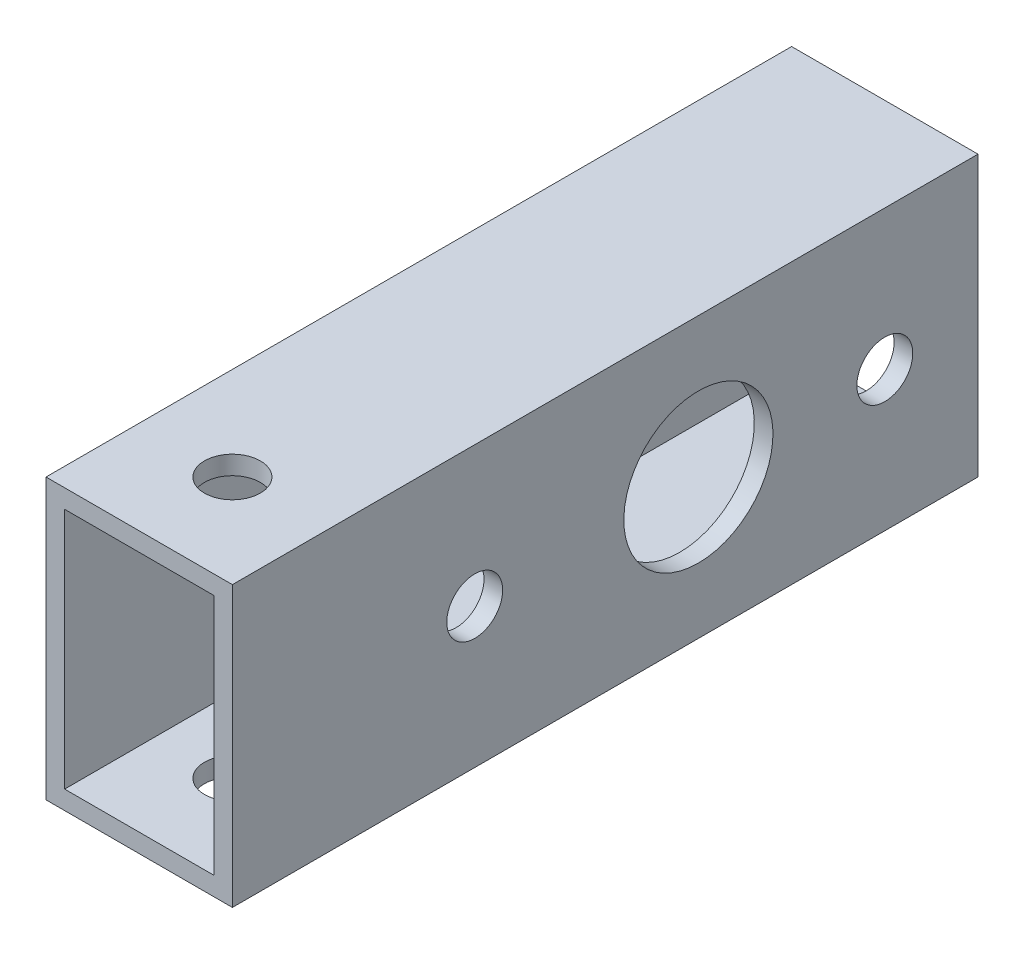
ISO-10303-21;
HEADER;
FILE_DESCRIPTION(('STEP AP214'),'2;1');
FILE_NAME('part.step','',(''),(''),'','','');
FILE_SCHEMA(('AUTOMOTIVE_DESIGN { 1 0 10303 214 1 1 1 1 }'));
ENDSEC;
DATA;
#1=APPLICATION_CONTEXT('core data for automotive mechanical design processes');
#2=APPLICATION_PROTOCOL_DEFINITION('international standard','automotive_design',2000,#1);
#3=PRODUCT_CONTEXT('',#1,'mechanical');
#4=PRODUCT('Part','Part','',(#3));
#5=PRODUCT_RELATED_PRODUCT_CATEGORY('part','',(#4));
#6=PRODUCT_DEFINITION_FORMATION('','',#4);
#7=PRODUCT_DEFINITION_CONTEXT('part definition',#1,'design');
#8=PRODUCT_DEFINITION('design','',#6,#7);
#9=PRODUCT_DEFINITION_SHAPE('','',#8);
#10=(LENGTH_UNIT() NAMED_UNIT(*) SI_UNIT(.MILLI.,.METRE.));
#11=(NAMED_UNIT(*) PLANE_ANGLE_UNIT() SI_UNIT($,.RADIAN.));
#12=(NAMED_UNIT(*) SI_UNIT($,.STERADIAN.) SOLID_ANGLE_UNIT());
#13=UNCERTAINTY_MEASURE_WITH_UNIT(LENGTH_MEASURE(1.E-05),#10,'distance_accuracy_value','');
#14=(GEOMETRIC_REPRESENTATION_CONTEXT(3) GLOBAL_UNCERTAINTY_ASSIGNED_CONTEXT((#13)) GLOBAL_UNIT_ASSIGNED_CONTEXT((#10,
#11,#12)) REPRESENTATION_CONTEXT('',''));
#15=CARTESIAN_POINT('',(0.,0.,0.));
#16=DIRECTION('',(0.,0.,1.));
#17=DIRECTION('',(1.,0.,0.));
#18=AXIS2_PLACEMENT_3D('',#15,#16,#17);
#19=CARTESIAN_POINT('',(0.,0.,40.));
#20=DIRECTION('',(0.,0.,1.));
#21=DIRECTION('',(1.,0.,0.));
#22=AXIS2_PLACEMENT_3D('',#19,#20,#21);
#23=PLANE('',#22);
#24=DIRECTION('',(0.,1.,0.));
#25=VECTOR('',#24,1.);
#26=CARTESIAN_POINT('',(93.1003139228142,55.9367021607542,40.));
#27=LINE('',#26,#25);
#28=CARTESIAN_POINT('',(93.1003139228142,40.9367021607542,40.));
#29=VERTEX_POINT('',#28);
#30=CARTESIAN_POINT('',(93.1003139228142,55.9367021607542,40.));
#31=VERTEX_POINT('',#30);
#32=EDGE_CURVE('E168',#29,#31,#27,.T.);
#33=ORIENTED_EDGE('',*,*,#32,.T.);
#34=DIRECTION('',(-1.,0.,0.));
#35=VECTOR('',#34,1.);
#36=CARTESIAN_POINT('',(93.1003139228142,55.9367021607542,40.));
#37=LINE('',#36,#35);
#38=CARTESIAN_POINT('',(83.1003139228142,55.9367021607542,40.));
#39=VERTEX_POINT('',#38);
#40=EDGE_CURVE('E171',#31,#39,#37,.T.);
#41=ORIENTED_EDGE('',*,*,#40,.T.);
#42=DIRECTION('',(0.,-1.,0.));
#43=VECTOR('',#42,1.);
#44=CARTESIAN_POINT('',(83.1003139228142,55.9367021607542,40.));
#45=LINE('',#44,#43);
#46=CARTESIAN_POINT('',(83.1003139228142,40.9367021607542,40.));
#47=VERTEX_POINT('',#46);
#48=EDGE_CURVE('E174',#39,#47,#45,.T.);
#49=ORIENTED_EDGE('',*,*,#48,.T.);
#50=DIRECTION('',(1.,0.,0.));
#51=VECTOR('',#50,1.);
#52=CARTESIAN_POINT('',(93.1003139228142,40.9367021607542,40.));
#53=LINE('',#52,#51);
#54=EDGE_CURVE('E176',#47,#29,#53,.T.);
#55=ORIENTED_EDGE('',*,*,#54,.T.);
#56=EDGE_LOOP('',(#33,#41,#49,#55));
#57=FACE_BOUND('',#56,.T.);
#58=DIRECTION('',(-1.,0.,0.));
#59=VECTOR('',#58,1.);
#60=CARTESIAN_POINT('',(0.,54.9367021607542,40.));
#61=LINE('',#60,#59);
#62=CARTESIAN_POINT('',(92.1003139228142,54.9367021607542,40.));
#63=VERTEX_POINT('',#62);
#64=CARTESIAN_POINT('',(84.1003139228142,54.9367021607542,40.));
#65=VERTEX_POINT('',#64);
#66=EDGE_CURVE('E138',#63,#65,#61,.T.);
#67=ORIENTED_EDGE('',*,*,#66,.F.);
#68=DIRECTION('',(0.,1.,0.));
#69=VECTOR('',#68,1.);
#70=CARTESIAN_POINT('',(92.1003139228142,0.,40.));
#71=LINE('',#70,#69);
#72=CARTESIAN_POINT('',(92.1003139228142,41.9367021607542,40.));
#73=VERTEX_POINT('',#72);
#74=EDGE_CURVE('E130',#73,#63,#71,.T.);
#75=ORIENTED_EDGE('',*,*,#74,.F.);
#76=DIRECTION('',(1.,0.,0.));
#77=VECTOR('',#76,1.);
#78=CARTESIAN_POINT('',(0.,41.9367021607542,40.));
#79=LINE('',#78,#77);
#80=CARTESIAN_POINT('',(84.1003139228142,41.9367021607542,40.));
#81=VERTEX_POINT('',#80);
#82=EDGE_CURVE('E152',#81,#73,#79,.T.);
#83=ORIENTED_EDGE('',*,*,#82,.F.);
#84=DIRECTION('',(0.,-1.,0.));
#85=VECTOR('',#84,1.);
#86=CARTESIAN_POINT('',(84.1003139228142,0.,40.));
#87=LINE('',#86,#85);
#88=EDGE_CURVE('E150',#65,#81,#87,.T.);
#89=ORIENTED_EDGE('',*,*,#88,.F.);
#90=EDGE_LOOP('',(#67,#75,#83,#89));
#91=FACE_BOUND('',#90,.T.);
#92=ADVANCED_FACE('F63',(#57,#91),#23,.T.);
#93=CARTESIAN_POINT('',(0.,0.,0.));
#94=DIRECTION('',(0.,0.,1.));
#95=DIRECTION('',(1.,0.,0.));
#96=AXIS2_PLACEMENT_3D('',#93,#94,#95);
#97=PLANE('',#96);
#98=DIRECTION('',(0.,1.,0.));
#99=VECTOR('',#98,1.);
#100=CARTESIAN_POINT('',(93.1003139228142,55.9367021607542,0.));
#101=LINE('',#100,#99);
#102=CARTESIAN_POINT('',(93.1003139228142,40.9367021607542,0.));
#103=VERTEX_POINT('',#102);
#104=CARTESIAN_POINT('',(93.1003139228142,55.9367021607542,0.));
#105=VERTEX_POINT('',#104);
#106=EDGE_CURVE('E146',#103,#105,#101,.T.);
#107=ORIENTED_EDGE('',*,*,#106,.F.);
#108=DIRECTION('',(1.,0.,0.));
#109=VECTOR('',#108,1.);
#110=CARTESIAN_POINT('',(93.1003139228142,40.9367021607542,0.));
#111=LINE('',#110,#109);
#112=CARTESIAN_POINT('',(83.1003139228142,40.9367021607542,0.));
#113=VERTEX_POINT('',#112);
#114=EDGE_CURVE('E172',#113,#103,#111,.T.);
#115=ORIENTED_EDGE('',*,*,#114,.F.);
#116=DIRECTION('',(0.,-1.,0.));
#117=VECTOR('',#116,1.);
#118=CARTESIAN_POINT('',(83.1003139228142,55.9367021607542,0.));
#119=LINE('',#118,#117);
#120=CARTESIAN_POINT('',(83.1003139228142,55.9367021607542,0.));
#121=VERTEX_POINT('',#120);
#122=EDGE_CURVE('E183',#121,#113,#119,.T.);
#123=ORIENTED_EDGE('',*,*,#122,.F.);
#124=DIRECTION('',(-1.,0.,0.));
#125=VECTOR('',#124,1.);
#126=CARTESIAN_POINT('',(93.1003139228142,55.9367021607542,0.));
#127=LINE('',#126,#125);
#128=EDGE_CURVE('E181',#105,#121,#127,.T.);
#129=ORIENTED_EDGE('',*,*,#128,.F.);
#130=EDGE_LOOP('',(#107,#115,#123,#129));
#131=FACE_BOUND('',#130,.T.);
#132=DIRECTION('',(0.,1.,0.));
#133=VECTOR('',#132,1.);
#134=CARTESIAN_POINT('',(92.1003139228142,0.,0.));
#135=LINE('',#134,#133);
#136=CARTESIAN_POINT('',(92.1003139228142,41.9367021607542,0.));
#137=VERTEX_POINT('',#136);
#138=CARTESIAN_POINT('',(92.1003139228142,54.9367021607542,0.));
#139=VERTEX_POINT('',#138);
#140=EDGE_CURVE('E88',#137,#139,#135,.T.);
#141=ORIENTED_EDGE('',*,*,#140,.T.);
#142=DIRECTION('',(-1.,0.,0.));
#143=VECTOR('',#142,1.);
#144=CARTESIAN_POINT('',(0.,54.9367021607542,0.));
#145=LINE('',#144,#143);
#146=CARTESIAN_POINT('',(84.1003139228142,54.9367021607542,0.));
#147=VERTEX_POINT('',#146);
#148=EDGE_CURVE('E145',#139,#147,#145,.T.);
#149=ORIENTED_EDGE('',*,*,#148,.T.);
#150=DIRECTION('',(0.,-1.,0.));
#151=VECTOR('',#150,1.);
#152=CARTESIAN_POINT('',(84.1003139228142,0.,0.));
#153=LINE('',#152,#151);
#154=CARTESIAN_POINT('',(84.1003139228142,41.9367021607542,0.));
#155=VERTEX_POINT('',#154);
#156=EDGE_CURVE('E160',#147,#155,#153,.T.);
#157=ORIENTED_EDGE('',*,*,#156,.T.);
#158=DIRECTION('',(1.,0.,0.));
#159=VECTOR('',#158,1.);
#160=CARTESIAN_POINT('',(0.,41.9367021607542,0.));
#161=LINE('',#160,#159);
#162=EDGE_CURVE('E139',#155,#137,#161,.T.);
#163=ORIENTED_EDGE('',*,*,#162,.T.);
#164=EDGE_LOOP('',(#141,#149,#157,#163));
#165=FACE_BOUND('',#164,.T.);
#166=ADVANCED_FACE('F253',(#131,#165),#97,.F.);
#167=CARTESIAN_POINT('',(93.1003139228142,55.9367021607542,40.));
#168=DIRECTION('',(-1.,0.,0.));
#169=DIRECTION('',(0.,0.,1.));
#170=AXIS2_PLACEMENT_3D('',#167,#168,#169);
#171=PLANE('',#170);
#172=CARTESIAN_POINT('',(93.1003139228142,48.4367021607542,5.));
#173=DIRECTION('',(-1.,0.,0.));
#174=DIRECTION('',(0.,-1.,0.));
#175=AXIS2_PLACEMENT_3D('',#172,#173,#174);
#176=CIRCLE('',#175,1.5);
#177=CARTESIAN_POINT('',(93.1003139228142,46.9367021607542,5.));
#178=VERTEX_POINT('',#177);
#179=EDGE_CURVE('E219',#178,#178,#176,.T.);
#180=ORIENTED_EDGE('',*,*,#179,.T.);
#181=EDGE_LOOP('',(#180));
#182=FACE_BOUND('',#181,.T.);
#183=CARTESIAN_POINT('',(93.1003139228142,48.4367021607542,27.));
#184=DIRECTION('',(-1.,0.,0.));
#185=DIRECTION('',(0.,-1.,0.));
#186=AXIS2_PLACEMENT_3D('',#183,#184,#185);
#187=CIRCLE('',#186,1.5);
#188=CARTESIAN_POINT('',(93.1003139228142,46.9367021607542,27.));
#189=VERTEX_POINT('',#188);
#190=EDGE_CURVE('E226',#189,#189,#187,.T.);
#191=ORIENTED_EDGE('',*,*,#190,.T.);
#192=EDGE_LOOP('',(#191));
#193=FACE_BOUND('',#192,.T.);
#194=CARTESIAN_POINT('',(93.1003139228142,48.4367021607542,15.));
#195=DIRECTION('',(-1.,0.,0.));
#196=DIRECTION('',(0.,-1.,0.));
#197=AXIS2_PLACEMENT_3D('',#194,#195,#196);
#198=CIRCLE('',#197,4.);
#199=CARTESIAN_POINT('',(93.1003139228142,44.4367021607542,15.));
#200=VERTEX_POINT('',#199);
#201=EDGE_CURVE('E197',#200,#200,#198,.T.);
#202=ORIENTED_EDGE('',*,*,#201,.T.);
#203=EDGE_LOOP('',(#202));
#204=FACE_BOUND('',#203,.T.);
#205=ORIENTED_EDGE('',*,*,#106,.T.);
#206=DIRECTION('',(0.,0.,-1.));
#207=VECTOR('',#206,1.);
#208=CARTESIAN_POINT('',(93.1003139228142,55.9367021607542,40.));
#209=LINE('',#208,#207);
#210=EDGE_CURVE('E12',#31,#105,#209,.T.);
#211=ORIENTED_EDGE('',*,*,#210,.F.);
#212=ORIENTED_EDGE('',*,*,#32,.F.);
#213=DIRECTION('',(0.,0.,-1.));
#214=VECTOR('',#213,1.);
#215=CARTESIAN_POINT('',(93.1003139228142,40.9367021607542,40.));
#216=LINE('',#215,#214);
#217=EDGE_CURVE('E178',#29,#103,#216,.T.);
#218=ORIENTED_EDGE('',*,*,#217,.T.);
#219=EDGE_LOOP('',(#205,#211,#212,#218));
#220=FACE_BOUND('',#219,.T.);
#221=ADVANCED_FACE('F65',(#182,#193,#204,#220),#171,.F.);
#222=CARTESIAN_POINT('',(93.1003139228142,55.9367021607542,40.));
#223=DIRECTION('',(0.,-1.,0.));
#224=DIRECTION('',(0.,0.,-1.));
#225=AXIS2_PLACEMENT_3D('',#222,#223,#224);
#226=PLANE('',#225);
#227=CARTESIAN_POINT('',(88.1003139228142,55.9367021607542,35.));
#228=DIRECTION('',(0.,-1.,0.));
#229=DIRECTION('',(0.,0.,-1.));
#230=AXIS2_PLACEMENT_3D('',#227,#228,#229);
#231=CIRCLE('',#230,1.5);
#232=CARTESIAN_POINT('',(88.1003139228142,55.9367021607542,33.5));
#233=VERTEX_POINT('',#232);
#234=EDGE_CURVE('E236',#233,#233,#231,.T.);
#235=ORIENTED_EDGE('',*,*,#234,.T.);
#236=EDGE_LOOP('',(#235));
#237=FACE_BOUND('',#236,.T.);
#238=ORIENTED_EDGE('',*,*,#128,.T.);
#239=DIRECTION('',(0.,0.,-1.));
#240=VECTOR('',#239,1.);
#241=CARTESIAN_POINT('',(83.1003139228142,55.9367021607542,40.));
#242=LINE('',#241,#240);
#243=EDGE_CURVE('E72',#39,#121,#242,.T.);
#244=ORIENTED_EDGE('',*,*,#243,.F.);
#245=ORIENTED_EDGE('',*,*,#40,.F.);
#246=ORIENTED_EDGE('',*,*,#210,.T.);
#247=EDGE_LOOP('',(#238,#244,#245,#246));
#248=FACE_BOUND('',#247,.T.);
#249=ADVANCED_FACE('F280',(#237,#248),#226,.F.);
#250=CARTESIAN_POINT('',(83.1003139228142,55.9367021607542,40.));
#251=DIRECTION('',(1.,0.,0.));
#252=DIRECTION('',(0.,1.,0.));
#253=AXIS2_PLACEMENT_3D('',#250,#251,#252);
#254=PLANE('',#253);
#255=CARTESIAN_POINT('',(83.1003139228142,48.4367021607542,5.));
#256=DIRECTION('',(-1.,0.,0.));
#257=DIRECTION('',(0.,-1.,0.));
#258=AXIS2_PLACEMENT_3D('',#255,#256,#257);
#259=CIRCLE('',#258,1.5);
#260=CARTESIAN_POINT('',(83.1003139228142,46.9367021607542,5.));
#261=VERTEX_POINT('',#260);
#262=EDGE_CURVE('E222',#261,#261,#259,.T.);
#263=ORIENTED_EDGE('',*,*,#262,.F.);
#264=EDGE_LOOP('',(#263));
#265=FACE_BOUND('',#264,.T.);
#266=CARTESIAN_POINT('',(83.1003139228142,48.4367021607542,27.));
#267=DIRECTION('',(-1.,0.,0.));
#268=DIRECTION('',(0.,-1.,0.));
#269=AXIS2_PLACEMENT_3D('',#266,#267,#268);
#270=CIRCLE('',#269,1.5);
#271=CARTESIAN_POINT('',(83.1003139228142,46.9367021607542,27.));
#272=VERTEX_POINT('',#271);
#273=EDGE_CURVE('E216',#272,#272,#270,.T.);
#274=ORIENTED_EDGE('',*,*,#273,.F.);
#275=EDGE_LOOP('',(#274));
#276=FACE_BOUND('',#275,.T.);
#277=CARTESIAN_POINT('',(83.1003139228142,48.4367021607542,15.));
#278=DIRECTION('',(-1.,0.,0.));
#279=DIRECTION('',(0.,-1.,0.));
#280=AXIS2_PLACEMENT_3D('',#277,#278,#279);
#281=CIRCLE('',#280,4.);
#282=CARTESIAN_POINT('',(83.1003139228142,44.4367021607542,15.));
#283=VERTEX_POINT('',#282);
#284=EDGE_CURVE('E213',#283,#283,#281,.T.);
#285=ORIENTED_EDGE('',*,*,#284,.F.);
#286=EDGE_LOOP('',(#285));
#287=FACE_BOUND('',#286,.T.);
#288=ORIENTED_EDGE('',*,*,#122,.T.);
#289=DIRECTION('',(0.,0.,-1.));
#290=VECTOR('',#289,1.);
#291=CARTESIAN_POINT('',(83.1003139228142,40.9367021607542,40.));
#292=LINE('',#291,#290);
#293=EDGE_CURVE('E188',#47,#113,#292,.T.);
#294=ORIENTED_EDGE('',*,*,#293,.F.);
#295=ORIENTED_EDGE('',*,*,#48,.F.);
#296=ORIENTED_EDGE('',*,*,#243,.T.);
#297=EDGE_LOOP('',(#288,#294,#295,#296));
#298=FACE_BOUND('',#297,.T.);
#299=ADVANCED_FACE('F277',(#265,#276,#287,#298),#254,.F.);
#300=CARTESIAN_POINT('',(93.1003139228142,40.9367021607542,40.));
#301=DIRECTION('',(0.,1.,0.));
#302=DIRECTION('',(0.,0.,1.));
#303=AXIS2_PLACEMENT_3D('',#300,#301,#302);
#304=PLANE('',#303);
#305=CARTESIAN_POINT('',(88.1003139228142,40.9367021607542,35.));
#306=DIRECTION('',(0.,-1.,0.));
#307=DIRECTION('',(0.,0.,-1.));
#308=AXIS2_PLACEMENT_3D('',#305,#306,#307);
#309=CIRCLE('',#308,1.5);
#310=CARTESIAN_POINT('',(88.1003139228142,40.9367021607542,33.5));
#311=VERTEX_POINT('',#310);
#312=EDGE_CURVE('E233',#311,#311,#309,.T.);
#313=ORIENTED_EDGE('',*,*,#312,.F.);
#314=EDGE_LOOP('',(#313));
#315=FACE_BOUND('',#314,.T.);
#316=ORIENTED_EDGE('',*,*,#114,.T.);
#317=ORIENTED_EDGE('',*,*,#217,.F.);
#318=ORIENTED_EDGE('',*,*,#54,.F.);
#319=ORIENTED_EDGE('',*,*,#293,.T.);
#320=EDGE_LOOP('',(#316,#317,#318,#319));
#321=FACE_BOUND('',#320,.T.);
#322=ADVANCED_FACE('F274',(#315,#321),#304,.F.);
#323=CARTESIAN_POINT('',(92.1003139228142,0.,40.));
#324=DIRECTION('',(-1.,0.,0.));
#325=DIRECTION('',(0.,0.,1.));
#326=AXIS2_PLACEMENT_3D('',#323,#324,#325);
#327=PLANE('',#326);
#328=CARTESIAN_POINT('',(92.1003139228142,48.4367021607542,5.));
#329=DIRECTION('',(-1.,0.,0.));
#330=DIRECTION('',(0.,0.,1.));
#331=AXIS2_PLACEMENT_3D('',#328,#329,#330);
#332=CIRCLE('',#331,1.5);
#333=CARTESIAN_POINT('',(92.1003139228142,48.4367021607542,6.50000000000001));
#334=VERTEX_POINT('',#333);
#335=EDGE_CURVE('E158',#334,#334,#332,.T.);
#336=ORIENTED_EDGE('',*,*,#335,.F.);
#337=EDGE_LOOP('',(#336));
#338=FACE_BOUND('',#337,.T.);
#339=CARTESIAN_POINT('',(92.1003139228142,48.4367021607542,27.));
#340=DIRECTION('',(-1.,0.,0.));
#341=DIRECTION('',(0.,0.,1.));
#342=AXIS2_PLACEMENT_3D('',#339,#340,#341);
#343=CIRCLE('',#342,1.5);
#344=CARTESIAN_POINT('',(92.1003139228142,48.4367021607542,28.5));
#345=VERTEX_POINT('',#344);
#346=EDGE_CURVE('E200',#345,#345,#343,.T.);
#347=ORIENTED_EDGE('',*,*,#346,.F.);
#348=EDGE_LOOP('',(#347));
#349=FACE_BOUND('',#348,.T.);
#350=CARTESIAN_POINT('',(92.1003139228142,48.4367021607542,15.));
#351=DIRECTION('',(-1.,0.,0.));
#352=DIRECTION('',(0.,0.,1.));
#353=AXIS2_PLACEMENT_3D('',#350,#351,#352);
#354=CIRCLE('',#353,4.);
#355=CARTESIAN_POINT('',(92.1003139228142,48.4367021607542,19.));
#356=VERTEX_POINT('',#355);
#357=EDGE_CURVE('E196',#356,#356,#354,.T.);
#358=ORIENTED_EDGE('',*,*,#357,.F.);
#359=EDGE_LOOP('',(#358));
#360=FACE_BOUND('',#359,.T.);
#361=ORIENTED_EDGE('',*,*,#140,.F.);
#362=DIRECTION('',(0.,0.,-1.));
#363=VECTOR('',#362,1.);
#364=CARTESIAN_POINT('',(92.1003139228142,41.9367021607542,40.));
#365=LINE('',#364,#363);
#366=EDGE_CURVE('E134',#73,#137,#365,.T.);
#367=ORIENTED_EDGE('',*,*,#366,.F.);
#368=ORIENTED_EDGE('',*,*,#74,.T.);
#369=DIRECTION('',(0.,0.,-1.));
#370=VECTOR('',#369,1.);
#371=CARTESIAN_POINT('',(92.1003139228142,54.9367021607542,40.));
#372=LINE('',#371,#370);
#373=EDGE_CURVE('E133',#63,#139,#372,.T.);
#374=ORIENTED_EDGE('',*,*,#373,.T.);
#375=EDGE_LOOP('',(#361,#367,#368,#374));
#376=FACE_BOUND('',#375,.T.);
#377=ADVANCED_FACE('F132',(#338,#349,#360,#376),#327,.T.);
#378=CARTESIAN_POINT('',(0.,54.9367021607542,40.));
#379=DIRECTION('',(0.,-1.,0.));
#380=DIRECTION('',(0.,0.,-1.));
#381=AXIS2_PLACEMENT_3D('',#378,#379,#380);
#382=PLANE('',#381);
#383=CARTESIAN_POINT('',(88.1003139228142,54.9367021607542,35.));
#384=DIRECTION('',(0.,-1.,0.));
#385=DIRECTION('',(0.,0.,-1.));
#386=AXIS2_PLACEMENT_3D('',#383,#384,#385);
#387=CIRCLE('',#386,1.5);
#388=CARTESIAN_POINT('',(88.1003139228142,54.9367021607542,33.5));
#389=VERTEX_POINT('',#388);
#390=EDGE_CURVE('E223',#389,#389,#387,.T.);
#391=ORIENTED_EDGE('',*,*,#390,.F.);
#392=EDGE_LOOP('',(#391));
#393=FACE_BOUND('',#392,.T.);
#394=ORIENTED_EDGE('',*,*,#148,.F.);
#395=ORIENTED_EDGE('',*,*,#373,.F.);
#396=ORIENTED_EDGE('',*,*,#66,.T.);
#397=DIRECTION('',(0.,0.,-1.));
#398=VECTOR('',#397,1.);
#399=CARTESIAN_POINT('',(84.1003139228142,54.9367021607542,40.));
#400=LINE('',#399,#398);
#401=EDGE_CURVE('E147',#65,#147,#400,.T.);
#402=ORIENTED_EDGE('',*,*,#401,.T.);
#403=EDGE_LOOP('',(#394,#395,#396,#402));
#404=FACE_BOUND('',#403,.T.);
#405=ADVANCED_FACE('F142',(#393,#404),#382,.T.);
#406=CARTESIAN_POINT('',(84.1003139228142,0.,40.));
#407=DIRECTION('',(1.,0.,0.));
#408=DIRECTION('',(0.,1.,0.));
#409=AXIS2_PLACEMENT_3D('',#406,#407,#408);
#410=PLANE('',#409);
#411=CARTESIAN_POINT('',(84.1003139228142,48.4367021607542,5.));
#412=DIRECTION('',(1.,0.,0.));
#413=DIRECTION('',(0.,1.,0.));
#414=AXIS2_PLACEMENT_3D('',#411,#412,#413);
#415=CIRCLE('',#414,1.5);
#416=CARTESIAN_POINT('',(84.1003139228142,49.9367021607542,5.));
#417=VERTEX_POINT('',#416);
#418=EDGE_CURVE('E201',#417,#417,#415,.T.);
#419=ORIENTED_EDGE('',*,*,#418,.F.);
#420=EDGE_LOOP('',(#419));
#421=FACE_BOUND('',#420,.T.);
#422=CARTESIAN_POINT('',(84.1003139228142,48.4367021607542,27.));
#423=DIRECTION('',(1.,0.,0.));
#424=DIRECTION('',(0.,1.,0.));
#425=AXIS2_PLACEMENT_3D('',#422,#423,#424);
#426=CIRCLE('',#425,1.5);
#427=CARTESIAN_POINT('',(84.1003139228142,49.9367021607542,27.));
#428=VERTEX_POINT('',#427);
#429=EDGE_CURVE('E198',#428,#428,#426,.T.);
#430=ORIENTED_EDGE('',*,*,#429,.F.);
#431=EDGE_LOOP('',(#430));
#432=FACE_BOUND('',#431,.T.);
#433=CARTESIAN_POINT('',(84.1003139228142,48.4367021607542,15.));
#434=DIRECTION('',(1.,0.,0.));
#435=DIRECTION('',(0.,1.,0.));
#436=AXIS2_PLACEMENT_3D('',#433,#434,#435);
#437=CIRCLE('',#436,4.);
#438=CARTESIAN_POINT('',(84.1003139228142,52.4367021607542,15.));
#439=VERTEX_POINT('',#438);
#440=EDGE_CURVE('E193',#439,#439,#437,.T.);
#441=ORIENTED_EDGE('',*,*,#440,.F.);
#442=EDGE_LOOP('',(#441));
#443=FACE_BOUND('',#442,.T.);
#444=ORIENTED_EDGE('',*,*,#156,.F.);
#445=ORIENTED_EDGE('',*,*,#401,.F.);
#446=ORIENTED_EDGE('',*,*,#88,.T.);
#447=DIRECTION('',(0.,0.,-1.));
#448=VECTOR('',#447,1.);
#449=CARTESIAN_POINT('',(84.1003139228142,41.9367021607542,40.));
#450=LINE('',#449,#448);
#451=EDGE_CURVE('E80',#81,#155,#450,.T.);
#452=ORIENTED_EDGE('',*,*,#451,.T.);
#453=EDGE_LOOP('',(#444,#445,#446,#452));
#454=FACE_BOUND('',#453,.T.);
#455=ADVANCED_FACE('F249',(#421,#432,#443,#454),#410,.T.);
#456=CARTESIAN_POINT('',(0.,41.9367021607542,40.));
#457=DIRECTION('',(0.,1.,0.));
#458=DIRECTION('',(0.,0.,1.));
#459=AXIS2_PLACEMENT_3D('',#456,#457,#458);
#460=PLANE('',#459);
#461=CARTESIAN_POINT('',(88.1003139228142,41.9367021607542,35.));
#462=DIRECTION('',(0.,1.,0.));
#463=DIRECTION('',(0.,0.,1.));
#464=AXIS2_PLACEMENT_3D('',#461,#462,#463);
#465=CIRCLE('',#464,1.5);
#466=CARTESIAN_POINT('',(88.1003139228142,41.9367021607542,36.5));
#467=VERTEX_POINT('',#466);
#468=EDGE_CURVE('E67',#467,#467,#465,.T.);
#469=ORIENTED_EDGE('',*,*,#468,.F.);
#470=EDGE_LOOP('',(#469));
#471=FACE_BOUND('',#470,.T.);
#472=ORIENTED_EDGE('',*,*,#162,.F.);
#473=ORIENTED_EDGE('',*,*,#451,.F.);
#474=ORIENTED_EDGE('',*,*,#82,.T.);
#475=ORIENTED_EDGE('',*,*,#366,.T.);
#476=EDGE_LOOP('',(#472,#473,#474,#475));
#477=FACE_BOUND('',#476,.T.);
#478=ADVANCED_FACE('F246',(#471,#477),#460,.T.);
#479=CARTESIAN_POINT('',(93.1003139228142,48.4367021607542,15.));
#480=DIRECTION('',(-1.,0.,0.));
#481=DIRECTION('',(0.,-1.,0.));
#482=AXIS2_PLACEMENT_3D('',#479,#480,#481);
#483=CYLINDRICAL_SURFACE('',#482,4.);
#484=ORIENTED_EDGE('',*,*,#440,.T.);
#485=EDGE_LOOP('',(#484));
#486=FACE_BOUND('',#485,.T.);
#487=ORIENTED_EDGE('',*,*,#284,.T.);
#488=EDGE_LOOP('',(#487));
#489=FACE_BOUND('',#488,.T.);
#490=ADVANCED_FACE('F248',(#486,#489),#483,.F.);
#491=CARTESIAN_POINT('',(93.1003139228142,48.4367021607542,27.));
#492=DIRECTION('',(-1.,0.,0.));
#493=DIRECTION('',(0.,-1.,0.));
#494=AXIS2_PLACEMENT_3D('',#491,#492,#493);
#495=CYLINDRICAL_SURFACE('',#494,1.5);
#496=ORIENTED_EDGE('',*,*,#429,.T.);
#497=EDGE_LOOP('',(#496));
#498=FACE_BOUND('',#497,.T.);
#499=ORIENTED_EDGE('',*,*,#273,.T.);
#500=EDGE_LOOP('',(#499));
#501=FACE_BOUND('',#500,.T.);
#502=ADVANCED_FACE('F321',(#498,#501),#495,.F.);
#503=CARTESIAN_POINT('',(93.1003139228142,48.4367021607542,5.));
#504=DIRECTION('',(-1.,0.,0.));
#505=DIRECTION('',(0.,-1.,0.));
#506=AXIS2_PLACEMENT_3D('',#503,#504,#505);
#507=CYLINDRICAL_SURFACE('',#506,1.5);
#508=ORIENTED_EDGE('',*,*,#418,.T.);
#509=EDGE_LOOP('',(#508));
#510=FACE_BOUND('',#509,.T.);
#511=ORIENTED_EDGE('',*,*,#262,.T.);
#512=EDGE_LOOP('',(#511));
#513=FACE_BOUND('',#512,.T.);
#514=ADVANCED_FACE('F312',(#510,#513),#507,.F.);
#515=ORIENTED_EDGE('',*,*,#357,.T.);
#516=EDGE_LOOP('',(#515));
#517=FACE_BOUND('',#516,.T.);
#518=ORIENTED_EDGE('',*,*,#201,.F.);
#519=EDGE_LOOP('',(#518));
#520=FACE_BOUND('',#519,.T.);
#521=ADVANCED_FACE('F309',(#517,#520),#483,.F.);
#522=ORIENTED_EDGE('',*,*,#346,.T.);
#523=EDGE_LOOP('',(#522));
#524=FACE_BOUND('',#523,.T.);
#525=ORIENTED_EDGE('',*,*,#190,.F.);
#526=EDGE_LOOP('',(#525));
#527=FACE_BOUND('',#526,.T.);
#528=ADVANCED_FACE('F311',(#524,#527),#495,.F.);
#529=ORIENTED_EDGE('',*,*,#335,.T.);
#530=EDGE_LOOP('',(#529));
#531=FACE_BOUND('',#530,.T.);
#532=ORIENTED_EDGE('',*,*,#179,.F.);
#533=EDGE_LOOP('',(#532));
#534=FACE_BOUND('',#533,.T.);
#535=ADVANCED_FACE('F319',(#531,#534),#507,.F.);
#536=CARTESIAN_POINT('',(88.1003139228142,55.9367021607542,35.));
#537=DIRECTION('',(0.,-1.,0.));
#538=DIRECTION('',(0.,0.,-1.));
#539=AXIS2_PLACEMENT_3D('',#536,#537,#538);
#540=CYLINDRICAL_SURFACE('',#539,1.5);
#541=ORIENTED_EDGE('',*,*,#468,.T.);
#542=EDGE_LOOP('',(#541));
#543=FACE_BOUND('',#542,.T.);
#544=ORIENTED_EDGE('',*,*,#312,.T.);
#545=EDGE_LOOP('',(#544));
#546=FACE_BOUND('',#545,.T.);
#547=ADVANCED_FACE('F243',(#543,#546),#540,.F.);
#548=ORIENTED_EDGE('',*,*,#390,.T.);
#549=EDGE_LOOP('',(#548));
#550=FACE_BOUND('',#549,.T.);
#551=ORIENTED_EDGE('',*,*,#234,.F.);
#552=EDGE_LOOP('',(#551));
#553=FACE_BOUND('',#552,.T.);
#554=ADVANCED_FACE('F339',(#550,#553),#540,.F.);
#555=CLOSED_SHELL('',(#92,#166,#221,#249,#299,#322,#377,#405,#455,#478,#490,#502,#514,#521,#528,
#535,#547,#554));
#556=MANIFOLD_SOLID_BREP('B2',#555);
#557=ADVANCED_BREP_SHAPE_REPRESENTATION('',(#18,#556),#14);
#558=SHAPE_DEFINITION_REPRESENTATION(#9,#557);
ENDSEC;
END-ISO-10303-21;
